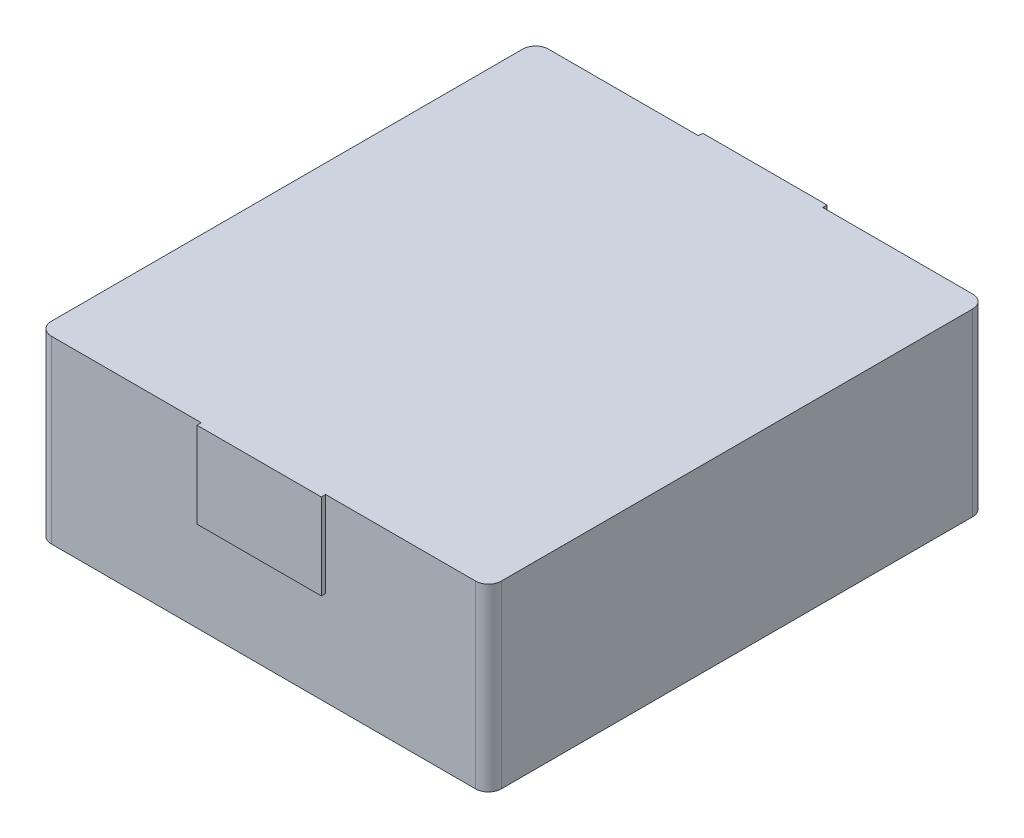
ISO-10303-21;
HEADER;
FILE_DESCRIPTION(('STEP AP214'),'2;1');
FILE_NAME('part.step','',(''),(''),'','','');
FILE_SCHEMA(('AUTOMOTIVE_DESIGN { 1 0 10303 214 1 1 1 1 }'));
ENDSEC;
DATA;
#1=APPLICATION_CONTEXT('core data for automotive mechanical design processes');
#2=APPLICATION_PROTOCOL_DEFINITION('international standard','automotive_design',2000,#1);
#3=PRODUCT_CONTEXT('',#1,'mechanical');
#4=PRODUCT('Part','Part','',(#3));
#5=PRODUCT_RELATED_PRODUCT_CATEGORY('part','',(#4));
#6=PRODUCT_DEFINITION_FORMATION('','',#4);
#7=PRODUCT_DEFINITION_CONTEXT('part definition',#1,'design');
#8=PRODUCT_DEFINITION('design','',#6,#7);
#9=PRODUCT_DEFINITION_SHAPE('','',#8);
#10=(LENGTH_UNIT() NAMED_UNIT(*) SI_UNIT(.MILLI.,.METRE.));
#11=(NAMED_UNIT(*) PLANE_ANGLE_UNIT() SI_UNIT($,.RADIAN.));
#12=(NAMED_UNIT(*) SI_UNIT($,.STERADIAN.) SOLID_ANGLE_UNIT());
#13=UNCERTAINTY_MEASURE_WITH_UNIT(LENGTH_MEASURE(1.E-05),#10,'distance_accuracy_value','');
#14=(GEOMETRIC_REPRESENTATION_CONTEXT(3) GLOBAL_UNCERTAINTY_ASSIGNED_CONTEXT((#13)) GLOBAL_UNIT_ASSIGNED_CONTEXT((#10,
#11,#12)) REPRESENTATION_CONTEXT('',''));
#15=CARTESIAN_POINT('',(0.,0.,0.));
#16=DIRECTION('',(0.,0.,1.));
#17=DIRECTION('',(1.,0.,0.));
#18=AXIS2_PLACEMENT_3D('',#15,#16,#17);
#19=CARTESIAN_POINT('',(32.2,5.8,-32.8));
#20=DIRECTION('',(0.,1.,0.));
#21=DIRECTION('',(0.,0.,1.));
#22=AXIS2_PLACEMENT_3D('',#19,#20,#21);
#23=PLANE('',#22);
#24=DIRECTION('',(0.,0.,1.));
#25=VECTOR('',#24,1.);
#26=CARTESIAN_POINT('',(35.1,5.8,-32.75));
#27=LINE('',#26,#25);
#28=CARTESIAN_POINT('',(35.1,5.8,-32.8));
#29=VERTEX_POINT('',#28);
#30=CARTESIAN_POINT('',(35.1,5.8,-32.7));
#31=VERTEX_POINT('',#30);
#32=EDGE_CURVE('E200',#29,#31,#27,.T.);
#33=ORIENTED_EDGE('',*,*,#32,.T.);
#34=DIRECTION('',(1.,0.,0.));
#35=VECTOR('',#34,1.);
#36=CARTESIAN_POINT('',(33.65,5.8,-32.7));
#37=LINE('',#36,#35);
#38=CARTESIAN_POINT('',(32.2,5.8,-32.7));
#39=VERTEX_POINT('',#38);
#40=EDGE_CURVE('E152',#39,#31,#37,.T.);
#41=ORIENTED_EDGE('',*,*,#40,.F.);
#42=DIRECTION('',(0.,0.,-1.));
#43=VECTOR('',#42,1.);
#44=CARTESIAN_POINT('',(32.2,5.8,-32.75));
#45=LINE('',#44,#43);
#46=CARTESIAN_POINT('',(32.2,5.8,-32.8));
#47=VERTEX_POINT('',#46);
#48=EDGE_CURVE('E199',#39,#47,#45,.T.);
#49=ORIENTED_EDGE('',*,*,#48,.T.);
#50=DIRECTION('',(1.,0.,0.));
#51=VECTOR('',#50,1.);
#52=CARTESIAN_POINT('',(33.65,5.8,-32.8));
#53=LINE('',#52,#51);
#54=EDGE_CURVE('E240',#47,#29,#53,.T.);
#55=ORIENTED_EDGE('',*,*,#54,.T.);
#56=EDGE_LOOP('',(#33,#41,#49,#55));
#57=FACE_BOUND('',#56,.T.);
#58=ADVANCED_FACE('F17',(#57),#23,.F.);
#59=CARTESIAN_POINT('',(35.1,7.8,-32.7));
#60=DIRECTION('',(-1.,0.,0.));
#61=DIRECTION('',(0.,0.,-1.));
#62=AXIS2_PLACEMENT_3D('',#59,#60,#61);
#63=PLANE('',#62);
#64=ORIENTED_EDGE('',*,*,#32,.F.);
#65=DIRECTION('',(0.,1.,0.));
#66=VECTOR('',#65,1.);
#67=CARTESIAN_POINT('',(35.1,6.8,-32.8));
#68=LINE('',#67,#66);
#69=CARTESIAN_POINT('',(35.1,7.8,-32.8));
#70=VERTEX_POINT('',#69);
#71=EDGE_CURVE('E209',#29,#70,#68,.T.);
#72=ORIENTED_EDGE('',*,*,#71,.T.);
#73=DIRECTION('',(0.,0.,-1.));
#74=VECTOR('',#73,1.);
#75=CARTESIAN_POINT('',(35.1,7.8,-32.75));
#76=LINE('',#75,#74);
#77=CARTESIAN_POINT('',(35.1,7.8,-32.7));
#78=VERTEX_POINT('',#77);
#79=EDGE_CURVE('E71',#78,#70,#76,.T.);
#80=ORIENTED_EDGE('',*,*,#79,.F.);
#81=DIRECTION('',(0.,1.,0.));
#82=VECTOR('',#81,1.);
#83=CARTESIAN_POINT('',(35.1,5.7,-32.7));
#84=LINE('',#83,#82);
#85=EDGE_CURVE('E150',#31,#78,#84,.T.);
#86=ORIENTED_EDGE('',*,*,#85,.F.);
#87=EDGE_LOOP('',(#64,#72,#80,#86));
#88=FACE_BOUND('',#87,.T.);
#89=ADVANCED_FACE('F327',(#88),#63,.F.);
#90=CARTESIAN_POINT('',(32.2,7.8,-32.8));
#91=DIRECTION('',(1.,0.,0.));
#92=DIRECTION('',(0.,0.,1.));
#93=AXIS2_PLACEMENT_3D('',#90,#91,#92);
#94=PLANE('',#93);
#95=ORIENTED_EDGE('',*,*,#48,.F.);
#96=DIRECTION('',(0.,-1.,0.));
#97=VECTOR('',#96,1.);
#98=CARTESIAN_POINT('',(32.2,5.7,-32.7));
#99=LINE('',#98,#97);
#100=CARTESIAN_POINT('',(32.2,7.8,-32.7));
#101=VERTEX_POINT('',#100);
#102=EDGE_CURVE('E146',#101,#39,#99,.T.);
#103=ORIENTED_EDGE('',*,*,#102,.F.);
#104=DIRECTION('',(0.,0.,1.));
#105=VECTOR('',#104,1.);
#106=CARTESIAN_POINT('',(32.2,7.8,-32.75));
#107=LINE('',#106,#105);
#108=CARTESIAN_POINT('',(32.2,7.8,-32.8));
#109=VERTEX_POINT('',#108);
#110=EDGE_CURVE('E196',#109,#101,#107,.T.);
#111=ORIENTED_EDGE('',*,*,#110,.F.);
#112=DIRECTION('',(0.,-1.,0.));
#113=VECTOR('',#112,1.);
#114=CARTESIAN_POINT('',(32.2,6.8,-32.8));
#115=LINE('',#114,#113);
#116=EDGE_CURVE('E243',#109,#47,#115,.T.);
#117=ORIENTED_EDGE('',*,*,#116,.T.);
#118=EDGE_LOOP('',(#95,#103,#111,#117));
#119=FACE_BOUND('',#118,.T.);
#120=ADVANCED_FACE('F317',(#119),#94,.F.);
#121=CARTESIAN_POINT('',(38.6,3.6,-32.4));
#122=DIRECTION('',(0.,1.,0.));
#123=DIRECTION('',(0.,0.,1.));
#124=AXIS2_PLACEMENT_3D('',#121,#122,#123);
#125=CYLINDRICAL_SURFACE('',#124,0.299999999999995);
#126=CARTESIAN_POINT('',(38.6,3.6,-32.4));
#127=DIRECTION('',(0.,1.,0.));
#128=DIRECTION('',(0.,0.,1.));
#129=AXIS2_PLACEMENT_3D('',#126,#127,#128);
#130=CIRCLE('',#129,0.299999999999995);
#131=CARTESIAN_POINT('',(38.6,3.6,-32.7));
#132=VERTEX_POINT('',#131);
#133=CARTESIAN_POINT('',(38.9,3.6,-32.4));
#134=VERTEX_POINT('',#133);
#135=EDGE_CURVE('E248',#132,#134,#130,.F.);
#136=ORIENTED_EDGE('',*,*,#135,.F.);
#137=DIRECTION('',(0.,-1.,0.));
#138=VECTOR('',#137,1.);
#139=CARTESIAN_POINT('',(38.6,5.7,-32.7));
#140=LINE('',#139,#138);
#141=CARTESIAN_POINT('',(38.6,7.8,-32.7));
#142=VERTEX_POINT('',#141);
#143=EDGE_CURVE('E147',#142,#132,#140,.T.);
#144=ORIENTED_EDGE('',*,*,#143,.F.);
#145=CARTESIAN_POINT('',(38.6,7.8,-32.4));
#146=DIRECTION('',(0.,1.,0.));
#147=DIRECTION('',(0.,0.,1.));
#148=AXIS2_PLACEMENT_3D('',#145,#146,#147);
#149=CIRCLE('',#148,0.299999999999995);
#150=CARTESIAN_POINT('',(38.9,7.8,-32.4));
#151=VERTEX_POINT('',#150);
#152=EDGE_CURVE('E21',#151,#142,#149,.T.);
#153=ORIENTED_EDGE('',*,*,#152,.F.);
#154=DIRECTION('',(0.,1.,0.));
#155=VECTOR('',#154,1.);
#156=CARTESIAN_POINT('',(38.9,5.7,-32.4));
#157=LINE('',#156,#155);
#158=EDGE_CURVE('E141',#134,#151,#157,.T.);
#159=ORIENTED_EDGE('',*,*,#158,.F.);
#160=EDGE_LOOP('',(#136,#144,#153,#159));
#161=FACE_BOUND('',#160,.T.);
#162=ADVANCED_FACE('F314',(#161),#125,.T.);
#163=CARTESIAN_POINT('',(32.2,5.8,-21.));
#164=DIRECTION('',(0.,-1.,0.));
#165=DIRECTION('',(0.,0.,-1.));
#166=AXIS2_PLACEMENT_3D('',#163,#164,#165);
#167=PLANE('',#166);
#168=DIRECTION('',(1.,0.,0.));
#169=VECTOR('',#168,1.);
#170=CARTESIAN_POINT('',(33.65,5.8,-21.));
#171=LINE('',#170,#169);
#172=CARTESIAN_POINT('',(32.2,5.8,-21.));
#173=VERTEX_POINT('',#172);
#174=CARTESIAN_POINT('',(35.1,5.8,-21.));
#175=VERTEX_POINT('',#174);
#176=EDGE_CURVE('E221',#173,#175,#171,.T.);
#177=ORIENTED_EDGE('',*,*,#176,.F.);
#178=DIRECTION('',(0.,0.,1.));
#179=VECTOR('',#178,1.);
#180=CARTESIAN_POINT('',(32.2,5.8,-21.05));
#181=LINE('',#180,#179);
#182=CARTESIAN_POINT('',(32.2,5.8,-21.1));
#183=VERTEX_POINT('',#182);
#184=EDGE_CURVE('E188',#183,#173,#181,.T.);
#185=ORIENTED_EDGE('',*,*,#184,.F.);
#186=DIRECTION('',(-1.,0.,0.));
#187=VECTOR('',#186,1.);
#188=CARTESIAN_POINT('',(33.65,5.8,-21.1));
#189=LINE('',#188,#187);
#190=CARTESIAN_POINT('',(35.1,5.8,-21.1));
#191=VERTEX_POINT('',#190);
#192=EDGE_CURVE('E178',#191,#183,#189,.T.);
#193=ORIENTED_EDGE('',*,*,#192,.F.);
#194=DIRECTION('',(0.,0.,-1.));
#195=VECTOR('',#194,1.);
#196=CARTESIAN_POINT('',(35.1,5.8,-21.05));
#197=LINE('',#196,#195);
#198=EDGE_CURVE('E170',#175,#191,#197,.T.);
#199=ORIENTED_EDGE('',*,*,#198,.F.);
#200=EDGE_LOOP('',(#177,#185,#193,#199));
#201=FACE_BOUND('',#200,.T.);
#202=ADVANCED_FACE('F316',(#201),#167,.T.);
#203=CARTESIAN_POINT('',(32.2,7.8,-21.));
#204=DIRECTION('',(-1.,0.,0.));
#205=DIRECTION('',(0.,0.,-1.));
#206=AXIS2_PLACEMENT_3D('',#203,#204,#205);
#207=PLANE('',#206);
#208=DIRECTION('',(0.,-1.,0.));
#209=VECTOR('',#208,1.);
#210=CARTESIAN_POINT('',(32.2,6.8,-21.));
#211=LINE('',#210,#209);
#212=CARTESIAN_POINT('',(32.2,7.8,-21.));
#213=VERTEX_POINT('',#212);
#214=EDGE_CURVE('E143',#213,#173,#211,.T.);
#215=ORIENTED_EDGE('',*,*,#214,.F.);
#216=DIRECTION('',(0.,0.,-1.));
#217=VECTOR('',#216,1.);
#218=CARTESIAN_POINT('',(32.2,7.8,-21.05));
#219=LINE('',#218,#217);
#220=CARTESIAN_POINT('',(32.2,7.8,-21.1));
#221=VERTEX_POINT('',#220);
#222=EDGE_CURVE('E185',#213,#221,#219,.T.);
#223=ORIENTED_EDGE('',*,*,#222,.T.);
#224=DIRECTION('',(0.,1.,0.));
#225=VECTOR('',#224,1.);
#226=CARTESIAN_POINT('',(32.2,5.7,-21.1));
#227=LINE('',#226,#225);
#228=EDGE_CURVE('E181',#183,#221,#227,.T.);
#229=ORIENTED_EDGE('',*,*,#228,.F.);
#230=ORIENTED_EDGE('',*,*,#184,.T.);
#231=EDGE_LOOP('',(#215,#223,#229,#230));
#232=FACE_BOUND('',#231,.T.);
#233=ADVANCED_FACE('F324',(#232),#207,.T.);
#234=CARTESIAN_POINT('',(38.6,3.6,-21.4));
#235=DIRECTION('',(0.,1.,0.));
#236=DIRECTION('',(0.,0.,1.));
#237=AXIS2_PLACEMENT_3D('',#234,#235,#236);
#238=CYLINDRICAL_SURFACE('',#237,0.300000000000005);
#239=CARTESIAN_POINT('',(38.6,3.6,-21.4));
#240=DIRECTION('',(0.,1.,0.));
#241=DIRECTION('',(0.,0.,1.));
#242=AXIS2_PLACEMENT_3D('',#239,#240,#241);
#243=CIRCLE('',#242,0.300000000000005);
#244=CARTESIAN_POINT('',(38.9,3.6,-21.4));
#245=VERTEX_POINT('',#244);
#246=CARTESIAN_POINT('',(38.6,3.6,-21.1));
#247=VERTEX_POINT('',#246);
#248=EDGE_CURVE('E106',#245,#247,#243,.F.);
#249=ORIENTED_EDGE('',*,*,#248,.F.);
#250=DIRECTION('',(0.,-1.,0.));
#251=VECTOR('',#250,1.);
#252=CARTESIAN_POINT('',(38.9,5.7,-21.4));
#253=LINE('',#252,#251);
#254=CARTESIAN_POINT('',(38.9,7.8,-21.4));
#255=VERTEX_POINT('',#254);
#256=EDGE_CURVE('E144',#255,#245,#253,.T.);
#257=ORIENTED_EDGE('',*,*,#256,.F.);
#258=CARTESIAN_POINT('',(38.6,7.8,-21.4));
#259=DIRECTION('',(0.,1.,0.));
#260=DIRECTION('',(0.,0.,1.));
#261=AXIS2_PLACEMENT_3D('',#258,#259,#260);
#262=CIRCLE('',#261,0.300000000000005);
#263=CARTESIAN_POINT('',(38.6,7.8,-21.1));
#264=VERTEX_POINT('',#263);
#265=EDGE_CURVE('E129',#264,#255,#262,.T.);
#266=ORIENTED_EDGE('',*,*,#265,.F.);
#267=DIRECTION('',(0.,1.,0.));
#268=VECTOR('',#267,1.);
#269=CARTESIAN_POINT('',(38.6,5.7,-21.1));
#270=LINE('',#269,#268);
#271=EDGE_CURVE('E121',#247,#264,#270,.T.);
#272=ORIENTED_EDGE('',*,*,#271,.F.);
#273=EDGE_LOOP('',(#249,#257,#266,#272));
#274=FACE_BOUND('',#273,.T.);
#275=ADVANCED_FACE('F128',(#274),#238,.T.);
#276=CARTESIAN_POINT('',(35.1,7.8,-21.1));
#277=DIRECTION('',(1.,0.,0.));
#278=DIRECTION('',(0.,0.,1.));
#279=AXIS2_PLACEMENT_3D('',#276,#277,#278);
#280=PLANE('',#279);
#281=DIRECTION('',(0.,1.,0.));
#282=VECTOR('',#281,1.);
#283=CARTESIAN_POINT('',(35.1,6.8,-21.));
#284=LINE('',#283,#282);
#285=CARTESIAN_POINT('',(35.1,7.8,-21.));
#286=VERTEX_POINT('',#285);
#287=EDGE_CURVE('E182',#175,#286,#284,.T.);
#288=ORIENTED_EDGE('',*,*,#287,.F.);
#289=ORIENTED_EDGE('',*,*,#198,.T.);
#290=DIRECTION('',(0.,-1.,0.));
#291=VECTOR('',#290,1.);
#292=CARTESIAN_POINT('',(35.1,5.7,-21.1));
#293=LINE('',#292,#291);
#294=CARTESIAN_POINT('',(35.1,7.8,-21.1));
#295=VERTEX_POINT('',#294);
#296=EDGE_CURVE('E130',#295,#191,#293,.T.);
#297=ORIENTED_EDGE('',*,*,#296,.F.);
#298=DIRECTION('',(0.,0.,1.));
#299=VECTOR('',#298,1.);
#300=CARTESIAN_POINT('',(35.1,7.8,-21.05));
#301=LINE('',#300,#299);
#302=EDGE_CURVE('E167',#295,#286,#301,.T.);
#303=ORIENTED_EDGE('',*,*,#302,.T.);
#304=EDGE_LOOP('',(#288,#289,#297,#303));
#305=FACE_BOUND('',#304,.T.);
#306=ADVANCED_FACE('F355',(#305),#280,.T.);
#307=CARTESIAN_POINT('',(28.7,3.6,-21.4));
#308=DIRECTION('',(0.,1.,0.));
#309=DIRECTION('',(0.,0.,1.));
#310=AXIS2_PLACEMENT_3D('',#307,#308,#309);
#311=CYLINDRICAL_SURFACE('',#310,0.299999999999998);
#312=CARTESIAN_POINT('',(28.7,3.6,-21.4));
#313=DIRECTION('',(0.,1.,0.));
#314=DIRECTION('',(0.,0.,1.));
#315=AXIS2_PLACEMENT_3D('',#312,#313,#314);
#316=CIRCLE('',#315,0.299999999999998);
#317=CARTESIAN_POINT('',(28.7,3.6,-21.1));
#318=VERTEX_POINT('',#317);
#319=CARTESIAN_POINT('',(28.4,3.6,-21.4));
#320=VERTEX_POINT('',#319);
#321=EDGE_CURVE('E115',#318,#320,#316,.F.);
#322=ORIENTED_EDGE('',*,*,#321,.F.);
#323=DIRECTION('',(0.,-1.,0.));
#324=VECTOR('',#323,1.);
#325=CARTESIAN_POINT('',(28.7,5.7,-21.1));
#326=LINE('',#325,#324);
#327=CARTESIAN_POINT('',(28.7,7.8,-21.1));
#328=VERTEX_POINT('',#327);
#329=EDGE_CURVE('E125',#328,#318,#326,.T.);
#330=ORIENTED_EDGE('',*,*,#329,.F.);
#331=CARTESIAN_POINT('',(28.7,7.8,-21.4));
#332=DIRECTION('',(0.,1.,0.));
#333=DIRECTION('',(0.,0.,1.));
#334=AXIS2_PLACEMENT_3D('',#331,#332,#333);
#335=CIRCLE('',#334,0.299999999999998);
#336=CARTESIAN_POINT('',(28.4,7.8,-21.4));
#337=VERTEX_POINT('',#336);
#338=EDGE_CURVE('E175',#337,#328,#335,.T.);
#339=ORIENTED_EDGE('',*,*,#338,.F.);
#340=DIRECTION('',(0.,1.,0.));
#341=VECTOR('',#340,1.);
#342=CARTESIAN_POINT('',(28.4,5.7,-21.4));
#343=LINE('',#342,#341);
#344=EDGE_CURVE('E133',#320,#337,#343,.T.);
#345=ORIENTED_EDGE('',*,*,#344,.F.);
#346=EDGE_LOOP('',(#322,#330,#339,#345));
#347=FACE_BOUND('',#346,.T.);
#348=ADVANCED_FACE('F302',(#347),#311,.T.);
#349=CARTESIAN_POINT('',(28.7,3.6,-32.4));
#350=DIRECTION('',(0.,1.,0.));
#351=DIRECTION('',(0.,0.,1.));
#352=AXIS2_PLACEMENT_3D('',#349,#350,#351);
#353=CYLINDRICAL_SURFACE('',#352,0.300000000000002);
#354=CARTESIAN_POINT('',(28.7,3.6,-32.4));
#355=DIRECTION('',(0.,1.,0.));
#356=DIRECTION('',(0.,0.,1.));
#357=AXIS2_PLACEMENT_3D('',#354,#355,#356);
#358=CIRCLE('',#357,0.300000000000002);
#359=CARTESIAN_POINT('',(28.4,3.6,-32.4));
#360=VERTEX_POINT('',#359);
#361=CARTESIAN_POINT('',(28.7,3.6,-32.7));
#362=VERTEX_POINT('',#361);
#363=EDGE_CURVE('E261',#360,#362,#358,.F.);
#364=ORIENTED_EDGE('',*,*,#363,.F.);
#365=DIRECTION('',(0.,-1.,0.));
#366=VECTOR('',#365,1.);
#367=CARTESIAN_POINT('',(28.4,5.7,-32.4));
#368=LINE('',#367,#366);
#369=CARTESIAN_POINT('',(28.4,7.8,-32.4));
#370=VERTEX_POINT('',#369);
#371=EDGE_CURVE('E166',#370,#360,#368,.T.);
#372=ORIENTED_EDGE('',*,*,#371,.F.);
#373=CARTESIAN_POINT('',(28.7,7.8,-32.4));
#374=DIRECTION('',(0.,1.,0.));
#375=DIRECTION('',(0.,0.,1.));
#376=AXIS2_PLACEMENT_3D('',#373,#374,#375);
#377=CIRCLE('',#376,0.300000000000002);
#378=CARTESIAN_POINT('',(28.7,7.8,-32.7));
#379=VERTEX_POINT('',#378);
#380=EDGE_CURVE('E36',#379,#370,#377,.T.);
#381=ORIENTED_EDGE('',*,*,#380,.F.);
#382=DIRECTION('',(0.,1.,0.));
#383=VECTOR('',#382,1.);
#384=CARTESIAN_POINT('',(28.7,5.7,-32.7));
#385=LINE('',#384,#383);
#386=EDGE_CURVE('E155',#362,#379,#385,.T.);
#387=ORIENTED_EDGE('',*,*,#386,.F.);
#388=EDGE_LOOP('',(#364,#372,#381,#387));
#389=FACE_BOUND('',#388,.T.);
#390=ADVANCED_FACE('F309',(#389),#353,.T.);
#391=CARTESIAN_POINT('',(28.29395,3.6,-20.984));
#392=DIRECTION('',(0.,-1.,0.));
#393=DIRECTION('',(0.,0.,-1.));
#394=AXIS2_PLACEMENT_3D('',#391,#392,#393);
#395=PLANE('',#394);
#396=ORIENTED_EDGE('',*,*,#135,.T.);
#397=DIRECTION('',(0.,0.,-1.));
#398=VECTOR('',#397,1.);
#399=CARTESIAN_POINT('',(38.9,3.6,-26.9));
#400=LINE('',#399,#398);
#401=EDGE_CURVE('E111',#245,#134,#400,.T.);
#402=ORIENTED_EDGE('',*,*,#401,.F.);
#403=ORIENTED_EDGE('',*,*,#248,.T.);
#404=DIRECTION('',(1.,0.,0.));
#405=VECTOR('',#404,1.);
#406=CARTESIAN_POINT('',(33.65,3.6,-21.1));
#407=LINE('',#406,#405);
#408=EDGE_CURVE('E109',#318,#247,#407,.T.);
#409=ORIENTED_EDGE('',*,*,#408,.F.);
#410=ORIENTED_EDGE('',*,*,#321,.T.);
#411=DIRECTION('',(0.,0.,1.));
#412=VECTOR('',#411,1.);
#413=CARTESIAN_POINT('',(28.4,3.6,-26.9));
#414=LINE('',#413,#412);
#415=EDGE_CURVE('E162',#360,#320,#414,.T.);
#416=ORIENTED_EDGE('',*,*,#415,.F.);
#417=ORIENTED_EDGE('',*,*,#363,.T.);
#418=DIRECTION('',(-1.,0.,0.));
#419=VECTOR('',#418,1.);
#420=CARTESIAN_POINT('',(33.65,3.6,-32.7));
#421=LINE('',#420,#419);
#422=EDGE_CURVE('E149',#132,#362,#421,.T.);
#423=ORIENTED_EDGE('',*,*,#422,.F.);
#424=EDGE_LOOP('',(#396,#402,#403,#409,#410,#416,#417,#423));
#425=FACE_BOUND('',#424,.T.);
#426=ADVANCED_FACE('F108',(#425),#395,.T.);
#427=CARTESIAN_POINT('',(35.1,7.8,-32.8));
#428=DIRECTION('',(0.,0.,1.));
#429=DIRECTION('',(-1.,0.,0.));
#430=AXIS2_PLACEMENT_3D('',#427,#428,#429);
#431=PLANE('',#430);
#432=ORIENTED_EDGE('',*,*,#54,.F.);
#433=ORIENTED_EDGE('',*,*,#116,.F.);
#434=DIRECTION('',(1.,0.,0.));
#435=VECTOR('',#434,1.);
#436=CARTESIAN_POINT('',(33.649475,7.8,-32.8));
#437=LINE('',#436,#435);
#438=EDGE_CURVE('E251',#109,#70,#437,.T.);
#439=ORIENTED_EDGE('',*,*,#438,.T.);
#440=ORIENTED_EDGE('',*,*,#71,.F.);
#441=EDGE_LOOP('',(#432,#433,#439,#440));
#442=FACE_BOUND('',#441,.T.);
#443=ADVANCED_FACE('F349',(#442),#431,.F.);
#444=CARTESIAN_POINT('',(28.7,7.8,-32.7));
#445=DIRECTION('',(0.,0.,-1.));
#446=DIRECTION('',(1.,0.,0.));
#447=AXIS2_PLACEMENT_3D('',#444,#445,#446);
#448=PLANE('',#447);
#449=DIRECTION('',(1.,0.,0.));
#450=VECTOR('',#449,1.);
#451=CARTESIAN_POINT('',(33.649475,7.8,-32.7));
#452=LINE('',#451,#450);
#453=EDGE_CURVE('E165',#379,#101,#452,.T.);
#454=ORIENTED_EDGE('',*,*,#453,.T.);
#455=ORIENTED_EDGE('',*,*,#102,.T.);
#456=ORIENTED_EDGE('',*,*,#40,.T.);
#457=ORIENTED_EDGE('',*,*,#85,.T.);
#458=DIRECTION('',(1.,0.,0.));
#459=VECTOR('',#458,1.);
#460=CARTESIAN_POINT('',(33.649475,7.8,-32.7));
#461=LINE('',#460,#459);
#462=EDGE_CURVE('E254',#78,#142,#461,.T.);
#463=ORIENTED_EDGE('',*,*,#462,.T.);
#464=ORIENTED_EDGE('',*,*,#143,.T.);
#465=ORIENTED_EDGE('',*,*,#422,.T.);
#466=ORIENTED_EDGE('',*,*,#386,.T.);
#467=EDGE_LOOP('',(#454,#455,#456,#457,#463,#464,#465,#466));
#468=FACE_BOUND('',#467,.T.);
#469=ADVANCED_FACE('F312',(#468),#448,.T.);
#470=CARTESIAN_POINT('',(38.9,7.8,-32.4));
#471=DIRECTION('',(1.,0.,0.));
#472=DIRECTION('',(0.,0.,1.));
#473=AXIS2_PLACEMENT_3D('',#470,#471,#472);
#474=PLANE('',#473);
#475=ORIENTED_EDGE('',*,*,#158,.T.);
#476=DIRECTION('',(0.,0.,1.));
#477=VECTOR('',#476,1.);
#478=CARTESIAN_POINT('',(38.9,7.8,-26.9));
#479=LINE('',#478,#477);
#480=EDGE_CURVE('E266',#151,#255,#479,.T.);
#481=ORIENTED_EDGE('',*,*,#480,.T.);
#482=ORIENTED_EDGE('',*,*,#256,.T.);
#483=ORIENTED_EDGE('',*,*,#401,.T.);
#484=EDGE_LOOP('',(#475,#481,#482,#483));
#485=FACE_BOUND('',#484,.T.);
#486=ADVANCED_FACE('F269',(#485),#474,.T.);
#487=CARTESIAN_POINT('',(35.1,7.8,-21.));
#488=DIRECTION('',(0.,0.,1.));
#489=DIRECTION('',(-1.,0.,0.));
#490=AXIS2_PLACEMENT_3D('',#487,#488,#489);
#491=PLANE('',#490);
#492=ORIENTED_EDGE('',*,*,#176,.T.);
#493=ORIENTED_EDGE('',*,*,#287,.T.);
#494=DIRECTION('',(-1.,0.,0.));
#495=VECTOR('',#494,1.);
#496=CARTESIAN_POINT('',(33.649475,7.8,-21.));
#497=LINE('',#496,#495);
#498=EDGE_CURVE('E230',#286,#213,#497,.T.);
#499=ORIENTED_EDGE('',*,*,#498,.T.);
#500=ORIENTED_EDGE('',*,*,#214,.T.);
#501=EDGE_LOOP('',(#492,#493,#499,#500));
#502=FACE_BOUND('',#501,.T.);
#503=ADVANCED_FACE('F339',(#502),#491,.T.);
#504=CARTESIAN_POINT('',(38.6,7.8,-21.1));
#505=DIRECTION('',(0.,0.,1.));
#506=DIRECTION('',(-1.,0.,0.));
#507=AXIS2_PLACEMENT_3D('',#504,#505,#506);
#508=PLANE('',#507);
#509=DIRECTION('',(-1.,0.,0.));
#510=VECTOR('',#509,1.);
#511=CARTESIAN_POINT('',(33.649475,7.8,-21.1));
#512=LINE('',#511,#510);
#513=EDGE_CURVE('E233',#264,#295,#512,.T.);
#514=ORIENTED_EDGE('',*,*,#513,.T.);
#515=ORIENTED_EDGE('',*,*,#296,.T.);
#516=ORIENTED_EDGE('',*,*,#192,.T.);
#517=ORIENTED_EDGE('',*,*,#228,.T.);
#518=DIRECTION('',(-1.,0.,0.));
#519=VECTOR('',#518,1.);
#520=CARTESIAN_POINT('',(33.649475,7.8,-21.1));
#521=LINE('',#520,#519);
#522=EDGE_CURVE('E27',#221,#328,#521,.T.);
#523=ORIENTED_EDGE('',*,*,#522,.T.);
#524=ORIENTED_EDGE('',*,*,#329,.T.);
#525=ORIENTED_EDGE('',*,*,#408,.T.);
#526=ORIENTED_EDGE('',*,*,#271,.T.);
#527=EDGE_LOOP('',(#514,#515,#516,#517,#523,#524,#525,#526));
#528=FACE_BOUND('',#527,.T.);
#529=ADVANCED_FACE('F120',(#528),#508,.T.);
#530=CARTESIAN_POINT('',(28.4,7.8,-21.4));
#531=DIRECTION('',(-1.,0.,0.));
#532=DIRECTION('',(0.,0.,-1.));
#533=AXIS2_PLACEMENT_3D('',#530,#531,#532);
#534=PLANE('',#533);
#535=ORIENTED_EDGE('',*,*,#371,.T.);
#536=ORIENTED_EDGE('',*,*,#415,.T.);
#537=ORIENTED_EDGE('',*,*,#344,.T.);
#538=DIRECTION('',(0.,0.,-1.));
#539=VECTOR('',#538,1.);
#540=CARTESIAN_POINT('',(28.4,7.8,-26.9));
#541=LINE('',#540,#539);
#542=EDGE_CURVE('E11',#337,#370,#541,.T.);
#543=ORIENTED_EDGE('',*,*,#542,.T.);
#544=EDGE_LOOP('',(#535,#536,#537,#543));
#545=FACE_BOUND('',#544,.T.);
#546=ADVANCED_FACE('F305',(#545),#534,.T.);
#547=CARTESIAN_POINT('',(28.29395,7.8,-21.));
#548=DIRECTION('',(0.,-1.,0.));
#549=DIRECTION('',(0.,0.,-1.));
#550=AXIS2_PLACEMENT_3D('',#547,#548,#549);
#551=PLANE('',#550);
#552=ORIENTED_EDGE('',*,*,#542,.F.);
#553=ORIENTED_EDGE('',*,*,#338,.T.);
#554=ORIENTED_EDGE('',*,*,#522,.F.);
#555=ORIENTED_EDGE('',*,*,#222,.F.);
#556=ORIENTED_EDGE('',*,*,#498,.F.);
#557=ORIENTED_EDGE('',*,*,#302,.F.);
#558=ORIENTED_EDGE('',*,*,#513,.F.);
#559=ORIENTED_EDGE('',*,*,#265,.T.);
#560=ORIENTED_EDGE('',*,*,#480,.F.);
#561=ORIENTED_EDGE('',*,*,#152,.T.);
#562=ORIENTED_EDGE('',*,*,#462,.F.);
#563=ORIENTED_EDGE('',*,*,#79,.T.);
#564=ORIENTED_EDGE('',*,*,#438,.F.);
#565=ORIENTED_EDGE('',*,*,#110,.T.);
#566=ORIENTED_EDGE('',*,*,#453,.F.);
#567=ORIENTED_EDGE('',*,*,#380,.T.);
#568=EDGE_LOOP('',(#552,#553,#554,#555,#556,#557,#558,#559,#560,#561,#562,#563,#564,#565,#566,#567));
#569=FACE_BOUND('',#568,.T.);
#570=ADVANCED_FACE('F19',(#569),#551,.F.);
#571=CLOSED_SHELL('',(#58,#89,#120,#162,#202,#233,#275,#306,#348,#390,#426,#443,#469,#486,#503,
#529,#546,#570));
#572=MANIFOLD_SOLID_BREP('B1',#571);
#573=ADVANCED_BREP_SHAPE_REPRESENTATION('',(#18,#572),#14);
#574=SHAPE_DEFINITION_REPRESENTATION(#9,#573);
ENDSEC;
END-ISO-10303-21;
